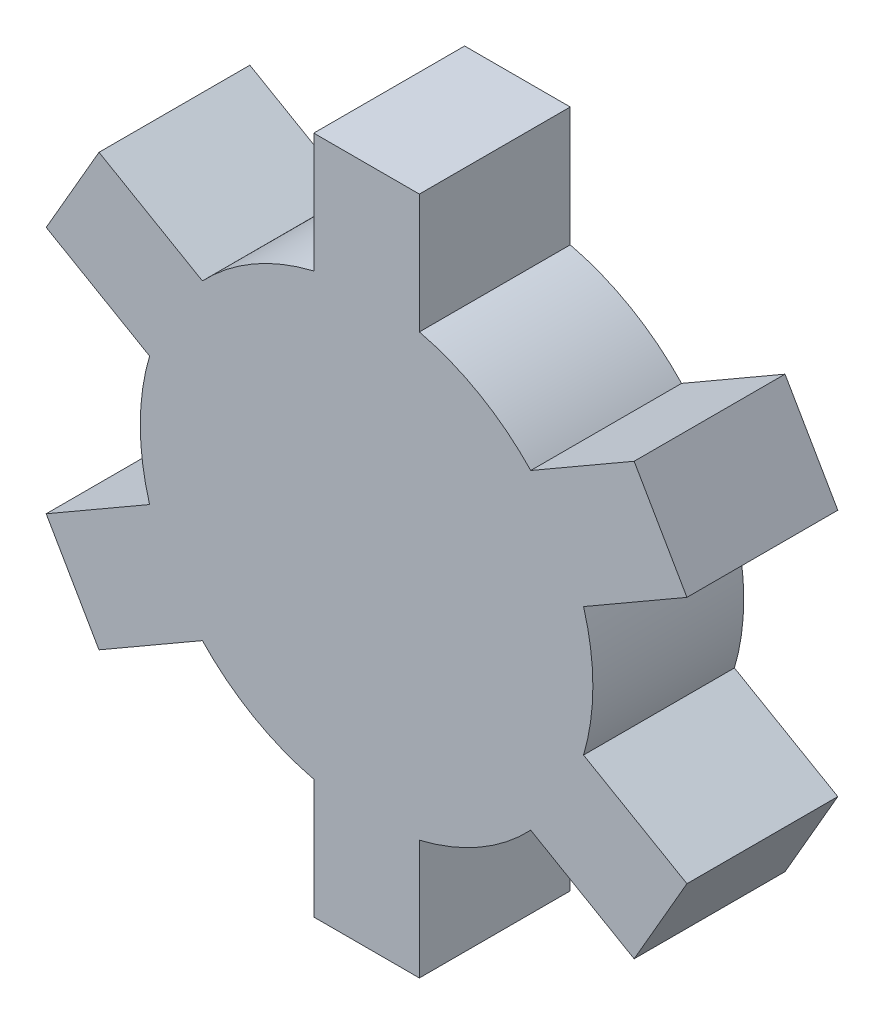
ISO-10303-21;
HEADER;
FILE_DESCRIPTION(('STEP AP214'),'2;1');
FILE_NAME('part.step','',(''),(''),'','','');
FILE_SCHEMA(('AUTOMOTIVE_DESIGN { 1 0 10303 214 1 1 1 1 }'));
ENDSEC;
DATA;
#1=APPLICATION_CONTEXT('core data for automotive mechanical design processes');
#2=APPLICATION_PROTOCOL_DEFINITION('international standard','automotive_design',2000,#1);
#3=PRODUCT_CONTEXT('',#1,'mechanical');
#4=PRODUCT('Part','Part','',(#3));
#5=PRODUCT_RELATED_PRODUCT_CATEGORY('part','',(#4));
#6=PRODUCT_DEFINITION_FORMATION('','',#4);
#7=PRODUCT_DEFINITION_CONTEXT('part definition',#1,'design');
#8=PRODUCT_DEFINITION('design','',#6,#7);
#9=PRODUCT_DEFINITION_SHAPE('','',#8);
#10=(LENGTH_UNIT() NAMED_UNIT(*) SI_UNIT(.MILLI.,.METRE.));
#11=(NAMED_UNIT(*) PLANE_ANGLE_UNIT() SI_UNIT($,.RADIAN.));
#12=(NAMED_UNIT(*) SI_UNIT($,.STERADIAN.) SOLID_ANGLE_UNIT());
#13=UNCERTAINTY_MEASURE_WITH_UNIT(LENGTH_MEASURE(1.E-05),#10,'distance_accuracy_value','');
#14=(GEOMETRIC_REPRESENTATION_CONTEXT(3) GLOBAL_UNCERTAINTY_ASSIGNED_CONTEXT((#13)) GLOBAL_UNIT_ASSIGNED_CONTEXT((#10,
#11,#12)) REPRESENTATION_CONTEXT('',''));
#15=CARTESIAN_POINT('',(0.,0.,0.));
#16=DIRECTION('',(0.,0.,1.));
#17=DIRECTION('',(1.,0.,0.));
#18=AXIS2_PLACEMENT_3D('',#15,#16,#17);
#19=CARTESIAN_POINT('',(0.,0.,10.));
#20=DIRECTION('',(0.,0.,-1.));
#21=DIRECTION('',(-1.,0.,0.));
#22=AXIS2_PLACEMENT_3D('',#19,#20,#21);
#23=CYLINDRICAL_SURFACE('',#22,15.);
#24=CARTESIAN_POINT('',(0.,0.,10.));
#25=DIRECTION('',(0.,0.,1.));
#26=DIRECTION('',(1.,0.,0.));
#27=AXIS2_PLACEMENT_3D('',#24,#25,#26);
#28=CIRCLE('',#27,15.);
#29=CARTESIAN_POINT('',(10.8818050966597,10.3240649861531,10.));
#30=VERTEX_POINT('',#29);
#31=CARTESIAN_POINT('',(3.5,14.5859521458148,10.));
#32=VERTEX_POINT('',#31);
#33=EDGE_CURVE('E45',#30,#32,#28,.T.);
#34=ORIENTED_EDGE('',*,*,#33,.F.);
#35=DIRECTION('',(0.,0.,-1.));
#36=VECTOR('',#35,1.);
#37=CARTESIAN_POINT('',(10.8818050966597,10.3240649861531,10.));
#38=LINE('',#37,#36);
#39=CARTESIAN_POINT('',(10.8818050966597,10.3240649861531,0.));
#40=VERTEX_POINT('',#39);
#41=EDGE_CURVE('E231',#30,#40,#38,.T.);
#42=ORIENTED_EDGE('',*,*,#41,.T.);
#43=CARTESIAN_POINT('',(0.,0.,0.));
#44=DIRECTION('',(0.,0.,1.));
#45=DIRECTION('',(1.,0.,0.));
#46=AXIS2_PLACEMENT_3D('',#43,#44,#45);
#47=CIRCLE('',#46,15.);
#48=CARTESIAN_POINT('',(3.5,14.5859521458148,0.));
#49=VERTEX_POINT('',#48);
#50=EDGE_CURVE('E356',#40,#49,#47,.T.);
#51=ORIENTED_EDGE('',*,*,#50,.T.);
#52=DIRECTION('',(0.,0.,-1.));
#53=VECTOR('',#52,1.);
#54=CARTESIAN_POINT('',(3.5,14.5859521458148,10.));
#55=LINE('',#54,#53);
#56=EDGE_CURVE('E352',#49,#32,#55,.F.);
#57=ORIENTED_EDGE('',*,*,#56,.T.);
#58=EDGE_LOOP('',(#34,#42,#51,#57));
#59=FACE_BOUND('',#58,.T.);
#60=ADVANCED_FACE('F35',(#59),#23,.T.);
#61=CARTESIAN_POINT('',(14.3818050966598,-4.26188715966174,0.));
#62=VERTEX_POINT('',#61);
#63=CARTESIAN_POINT('',(14.3818050966597,4.26188715966204,0.));
#64=VERTEX_POINT('',#63);
#65=EDGE_CURVE('E360',#62,#64,#47,.T.);
#66=ORIENTED_EDGE('',*,*,#65,.T.);
#67=DIRECTION('',(0.,0.,-1.));
#68=VECTOR('',#67,1.);
#69=CARTESIAN_POINT('',(14.3818050966597,4.26188715966204,10.));
#70=LINE('',#69,#68);
#71=CARTESIAN_POINT('',(14.3818050966597,4.26188715966204,10.));
#72=VERTEX_POINT('',#71);
#73=EDGE_CURVE('E59',#64,#72,#70,.F.);
#74=ORIENTED_EDGE('',*,*,#73,.T.);
#75=CARTESIAN_POINT('',(14.3818050966598,-4.26188715966174,10.));
#76=VERTEX_POINT('',#75);
#77=EDGE_CURVE('E206',#76,#72,#28,.T.);
#78=ORIENTED_EDGE('',*,*,#77,.F.);
#79=DIRECTION('',(0.,0.,-1.));
#80=VECTOR('',#79,1.);
#81=CARTESIAN_POINT('',(14.3818050966598,-4.26188715966174,10.));
#82=LINE('',#81,#80);
#83=EDGE_CURVE('E254',#76,#62,#82,.T.);
#84=ORIENTED_EDGE('',*,*,#83,.T.);
#85=EDGE_LOOP('',(#66,#74,#78,#84));
#86=FACE_BOUND('',#85,.T.);
#87=ADVANCED_FACE('F393',(#86),#23,.T.);
#88=CARTESIAN_POINT('',(3.5,-14.5859521458148,0.));
#89=VERTEX_POINT('',#88);
#90=CARTESIAN_POINT('',(10.8818050966599,-10.3240649861528,0.));
#91=VERTEX_POINT('',#90);
#92=EDGE_CURVE('E362',#89,#91,#47,.T.);
#93=ORIENTED_EDGE('',*,*,#92,.T.);
#94=DIRECTION('',(0.,0.,-1.));
#95=VECTOR('',#94,1.);
#96=CARTESIAN_POINT('',(10.8818050966599,-10.3240649861528,10.));
#97=LINE('',#96,#95);
#98=CARTESIAN_POINT('',(10.8818050966599,-10.3240649861528,10.));
#99=VERTEX_POINT('',#98);
#100=EDGE_CURVE('E252',#91,#99,#97,.F.);
#101=ORIENTED_EDGE('',*,*,#100,.T.);
#102=CARTESIAN_POINT('',(3.5,-14.5859521458148,10.));
#103=VERTEX_POINT('',#102);
#104=EDGE_CURVE('E394',#103,#99,#28,.T.);
#105=ORIENTED_EDGE('',*,*,#104,.F.);
#106=DIRECTION('',(0.,0.,-1.));
#107=VECTOR('',#106,1.);
#108=CARTESIAN_POINT('',(3.5,-14.5859521458148,10.));
#109=LINE('',#108,#107);
#110=EDGE_CURVE('E279',#103,#89,#109,.T.);
#111=ORIENTED_EDGE('',*,*,#110,.T.);
#112=EDGE_LOOP('',(#93,#101,#105,#111));
#113=FACE_BOUND('',#112,.T.);
#114=ADVANCED_FACE('F372',(#113),#23,.T.);
#115=CARTESIAN_POINT('',(-10.8818050966597,-10.324064986153,0.));
#116=VERTEX_POINT('',#115);
#117=CARTESIAN_POINT('',(-3.5,-14.5859521458148,0.));
#118=VERTEX_POINT('',#117);
#119=EDGE_CURVE('E365',#116,#118,#47,.T.);
#120=ORIENTED_EDGE('',*,*,#119,.T.);
#121=DIRECTION('',(0.,0.,-1.));
#122=VECTOR('',#121,1.);
#123=CARTESIAN_POINT('',(-3.5,-14.5859521458148,10.));
#124=LINE('',#123,#122);
#125=CARTESIAN_POINT('',(-3.5,-14.5859521458148,10.));
#126=VERTEX_POINT('',#125);
#127=EDGE_CURVE('E277',#118,#126,#124,.F.);
#128=ORIENTED_EDGE('',*,*,#127,.T.);
#129=CARTESIAN_POINT('',(-10.8818050966597,-10.324064986153,10.));
#130=VERTEX_POINT('',#129);
#131=EDGE_CURVE('E395',#130,#126,#28,.T.);
#132=ORIENTED_EDGE('',*,*,#131,.F.);
#133=DIRECTION('',(0.,0.,-1.));
#134=VECTOR('',#133,1.);
#135=CARTESIAN_POINT('',(-10.8818050966597,-10.324064986153,10.));
#136=LINE('',#135,#134);
#137=EDGE_CURVE('E304',#130,#116,#136,.T.);
#138=ORIENTED_EDGE('',*,*,#137,.T.);
#139=EDGE_LOOP('',(#120,#128,#132,#138));
#140=FACE_BOUND('',#139,.T.);
#141=ADVANCED_FACE('F416',(#140),#23,.T.);
#142=CARTESIAN_POINT('',(-14.3818050966598,4.26188715966184,0.));
#143=VERTEX_POINT('',#142);
#144=CARTESIAN_POINT('',(-14.3818050966598,-4.26188715966194,0.));
#145=VERTEX_POINT('',#144);
#146=EDGE_CURVE('E363',#143,#145,#47,.T.);
#147=ORIENTED_EDGE('',*,*,#146,.T.);
#148=DIRECTION('',(0.,0.,-1.));
#149=VECTOR('',#148,1.);
#150=CARTESIAN_POINT('',(-14.3818050966598,-4.26188715966194,10.));
#151=LINE('',#150,#149);
#152=CARTESIAN_POINT('',(-14.3818050966598,-4.26188715966194,10.));
#153=VERTEX_POINT('',#152);
#154=EDGE_CURVE('E302',#145,#153,#151,.F.);
#155=ORIENTED_EDGE('',*,*,#154,.T.);
#156=CARTESIAN_POINT('',(-14.3818050966598,4.26188715966184,10.));
#157=VERTEX_POINT('',#156);
#158=EDGE_CURVE('E44',#157,#153,#28,.T.);
#159=ORIENTED_EDGE('',*,*,#158,.F.);
#160=DIRECTION('',(0.,0.,-1.));
#161=VECTOR('',#160,1.);
#162=CARTESIAN_POINT('',(-14.3818050966598,4.26188715966184,10.));
#163=LINE('',#162,#161);
#164=EDGE_CURVE('E329',#157,#143,#163,.T.);
#165=ORIENTED_EDGE('',*,*,#164,.T.);
#166=EDGE_LOOP('',(#147,#155,#159,#165));
#167=FACE_BOUND('',#166,.T.);
#168=ADVANCED_FACE('F444',(#167),#23,.T.);
#169=CARTESIAN_POINT('',(-3.5,14.5859521458148,0.));
#170=VERTEX_POINT('',#169);
#171=CARTESIAN_POINT('',(-10.8818050966598,10.3240649861529,0.));
#172=VERTEX_POINT('',#171);
#173=EDGE_CURVE('E39',#170,#172,#47,.T.);
#174=ORIENTED_EDGE('',*,*,#173,.T.);
#175=DIRECTION('',(0.,0.,-1.));
#176=VECTOR('',#175,1.);
#177=CARTESIAN_POINT('',(-10.8818050966598,10.3240649861529,10.));
#178=LINE('',#177,#176);
#179=CARTESIAN_POINT('',(-10.8818050966598,10.3240649861529,10.));
#180=VERTEX_POINT('',#179);
#181=EDGE_CURVE('E327',#172,#180,#178,.F.);
#182=ORIENTED_EDGE('',*,*,#181,.T.);
#183=CARTESIAN_POINT('',(-3.5,14.5859521458148,10.));
#184=VERTEX_POINT('',#183);
#185=EDGE_CURVE('E11',#184,#180,#28,.T.);
#186=ORIENTED_EDGE('',*,*,#185,.F.);
#187=DIRECTION('',(0.,0.,-1.));
#188=VECTOR('',#187,1.);
#189=CARTESIAN_POINT('',(-3.5,14.5859521458148,10.));
#190=LINE('',#189,#188);
#191=EDGE_CURVE('E354',#184,#170,#190,.T.);
#192=ORIENTED_EDGE('',*,*,#191,.T.);
#193=EDGE_LOOP('',(#174,#182,#186,#192));
#194=FACE_BOUND('',#193,.T.);
#195=ADVANCED_FACE('F37',(#194),#23,.T.);
#196=CARTESIAN_POINT('',(0.,0.,10.));
#197=DIRECTION('',(0.,0.,1.));
#198=DIRECTION('',(1.,0.,0.));
#199=AXIS2_PLACEMENT_3D('',#196,#197,#198);
#200=PLANE('',#199);
#201=ORIENTED_EDGE('',*,*,#77,.T.);
#202=DIRECTION('',(0.866025403784433,0.50000000000001,0.));
#203=VECTOR('',#202,1.);
#204=CARTESIAN_POINT('',(8.24519052838328,0.718911086754561,10.));
#205=LINE('',#204,#203);
#206=CARTESIAN_POINT('',(21.2355715851498,8.21891108675471,10.));
#207=VERTEX_POINT('',#206);
#208=EDGE_CURVE('E198',#72,#207,#205,.T.);
#209=ORIENTED_EDGE('',*,*,#208,.T.);
#210=DIRECTION('',(-0.50000000000001,0.866025403784433,0.));
#211=VECTOR('',#210,1.);
#212=CARTESIAN_POINT('',(17.7355715851497,14.2810889132457,10.));
#213=LINE('',#212,#211);
#214=CARTESIAN_POINT('',(17.7355715851497,14.2810889132457,10.));
#215=VERTEX_POINT('',#214);
#216=EDGE_CURVE('E203',#207,#215,#213,.T.);
#217=ORIENTED_EDGE('',*,*,#216,.T.);
#218=DIRECTION('',(-0.866025403784433,-0.50000000000001,0.));
#219=VECTOR('',#218,1.);
#220=CARTESIAN_POINT('',(4.74519052838321,6.78108891324559,10.));
#221=LINE('',#220,#219);
#222=EDGE_CURVE('E218',#215,#30,#221,.T.);
#223=ORIENTED_EDGE('',*,*,#222,.T.);
#224=ORIENTED_EDGE('',*,*,#33,.T.);
#225=DIRECTION('',(0.,1.,0.));
#226=VECTOR('',#225,1.);
#227=CARTESIAN_POINT('',(3.5,7.5,10.));
#228=LINE('',#227,#226);
#229=CARTESIAN_POINT('',(3.5,22.5,10.));
#230=VERTEX_POINT('',#229);
#231=EDGE_CURVE('E332',#32,#230,#228,.T.);
#232=ORIENTED_EDGE('',*,*,#231,.T.);
#233=DIRECTION('',(-1.,0.,0.));
#234=VECTOR('',#233,1.);
#235=CARTESIAN_POINT('',(-3.5,22.5,10.));
#236=LINE('',#235,#234);
#237=CARTESIAN_POINT('',(-3.5,22.5,10.));
#238=VERTEX_POINT('',#237);
#239=EDGE_CURVE('E340',#230,#238,#236,.T.);
#240=ORIENTED_EDGE('',*,*,#239,.T.);
#241=DIRECTION('',(0.,-1.,0.));
#242=VECTOR('',#241,1.);
#243=CARTESIAN_POINT('',(-3.5,7.5,10.));
#244=LINE('',#243,#242);
#245=EDGE_CURVE('E343',#238,#184,#244,.T.);
#246=ORIENTED_EDGE('',*,*,#245,.T.);
#247=ORIENTED_EDGE('',*,*,#185,.T.);
#248=DIRECTION('',(-0.86602540378444,0.499999999999998,0.));
#249=VECTOR('',#248,1.);
#250=CARTESIAN_POINT('',(-4.74519052838331,6.78108891324552,10.));
#251=LINE('',#250,#249);
#252=CARTESIAN_POINT('',(-17.7355715851499,14.2810889132455,10.));
#253=VERTEX_POINT('',#252);
#254=EDGE_CURVE('E307',#180,#253,#251,.T.);
#255=ORIENTED_EDGE('',*,*,#254,.T.);
#256=DIRECTION('',(-0.499999999999998,-0.86602540378444,0.));
#257=VECTOR('',#256,1.);
#258=CARTESIAN_POINT('',(-21.2355715851499,8.21891108675442,10.));
#259=LINE('',#258,#257);
#260=CARTESIAN_POINT('',(-21.2355715851499,8.21891108675442,10.));
#261=VERTEX_POINT('',#260);
#262=EDGE_CURVE('E315',#253,#261,#259,.T.);
#263=ORIENTED_EDGE('',*,*,#262,.T.);
#264=DIRECTION('',(0.86602540378444,-0.499999999999998,0.));
#265=VECTOR('',#264,1.);
#266=CARTESIAN_POINT('',(-8.24519052838329,0.718911086754445,10.));
#267=LINE('',#266,#265);
#268=EDGE_CURVE('E318',#261,#157,#267,.T.);
#269=ORIENTED_EDGE('',*,*,#268,.T.);
#270=ORIENTED_EDGE('',*,*,#158,.T.);
#271=DIRECTION('',(-0.866025403784436,-0.500000000000004,0.));
#272=VECTOR('',#271,1.);
#273=CARTESIAN_POINT('',(-8.24519052838329,-0.718911086754503,10.));
#274=LINE('',#273,#272);
#275=CARTESIAN_POINT('',(-21.2355715851498,-8.21891108675456,10.));
#276=VERTEX_POINT('',#275);
#277=EDGE_CURVE('E282',#153,#276,#274,.T.);
#278=ORIENTED_EDGE('',*,*,#277,.T.);
#279=DIRECTION('',(0.500000000000004,-0.866025403784436,0.));
#280=VECTOR('',#279,1.);
#281=CARTESIAN_POINT('',(-17.7355715851498,-14.2810889132456,10.));
#282=LINE('',#281,#280);
#283=CARTESIAN_POINT('',(-17.7355715851498,-14.2810889132456,10.));
#284=VERTEX_POINT('',#283);
#285=EDGE_CURVE('E290',#276,#284,#282,.T.);
#286=ORIENTED_EDGE('',*,*,#285,.T.);
#287=DIRECTION('',(0.866025403784436,0.500000000000004,0.));
#288=VECTOR('',#287,1.);
#289=CARTESIAN_POINT('',(-4.74519052838326,-6.78108891324556,10.));
#290=LINE('',#289,#288);
#291=EDGE_CURVE('E293',#284,#130,#290,.T.);
#292=ORIENTED_EDGE('',*,*,#291,.T.);
#293=ORIENTED_EDGE('',*,*,#131,.T.);
#294=DIRECTION('',(0.,-1.,0.));
#295=VECTOR('',#294,1.);
#296=CARTESIAN_POINT('',(-3.5,-7.5,10.));
#297=LINE('',#296,#295);
#298=CARTESIAN_POINT('',(-3.5,-22.5,10.));
#299=VERTEX_POINT('',#298);
#300=EDGE_CURVE('E257',#126,#299,#297,.T.);
#301=ORIENTED_EDGE('',*,*,#300,.T.);
#302=DIRECTION('',(1.,0.,0.));
#303=VECTOR('',#302,1.);
#304=CARTESIAN_POINT('',(3.5,-22.5,10.));
#305=LINE('',#304,#303);
#306=CARTESIAN_POINT('',(3.5,-22.5,10.));
#307=VERTEX_POINT('',#306);
#308=EDGE_CURVE('E265',#299,#307,#305,.T.);
#309=ORIENTED_EDGE('',*,*,#308,.T.);
#310=DIRECTION('',(0.,1.,0.));
#311=VECTOR('',#310,1.);
#312=CARTESIAN_POINT('',(3.5,-7.5,10.));
#313=LINE('',#312,#311);
#314=EDGE_CURVE('E268',#307,#103,#313,.T.);
#315=ORIENTED_EDGE('',*,*,#314,.T.);
#316=ORIENTED_EDGE('',*,*,#104,.T.);
#317=DIRECTION('',(0.866025403784443,-0.499999999999992,0.));
#318=VECTOR('',#317,1.);
#319=CARTESIAN_POINT('',(4.74519052838335,-6.78108891324549,10.));
#320=LINE('',#319,#318);
#321=CARTESIAN_POINT('',(17.73557158515,-14.2810889132454,10.));
#322=VERTEX_POINT('',#321);
#323=EDGE_CURVE('E233',#99,#322,#320,.T.);
#324=ORIENTED_EDGE('',*,*,#323,.T.);
#325=DIRECTION('',(0.499999999999992,0.866025403784443,0.));
#326=VECTOR('',#325,1.);
#327=CARTESIAN_POINT('',(21.2355715851499,-8.21891108675427,10.));
#328=LINE('',#327,#326);
#329=CARTESIAN_POINT('',(21.2355715851499,-8.21891108675427,10.));
#330=VERTEX_POINT('',#329);
#331=EDGE_CURVE('E241',#322,#330,#328,.T.);
#332=ORIENTED_EDGE('',*,*,#331,.T.);
#333=DIRECTION('',(-0.866025403784443,0.499999999999992,0.));
#334=VECTOR('',#333,1.);
#335=CARTESIAN_POINT('',(8.2451905283833,-0.718911086754388,10.));
#336=LINE('',#335,#334);
#337=EDGE_CURVE('E244',#330,#76,#336,.T.);
#338=ORIENTED_EDGE('',*,*,#337,.T.);
#339=EDGE_LOOP('',(#201,#209,#217,#223,#224,#232,#240,#246,#247,#255,#263,#269,#270,#278,#286,
#292,#293,#301,#309,#315,#316,#324,#332,#338));
#340=FACE_BOUND('',#339,.T.);
#341=ADVANCED_FACE('F200',(#340),#200,.T.);
#342=CARTESIAN_POINT('',(0.,0.,0.));
#343=DIRECTION('',(0.,0.,1.));
#344=DIRECTION('',(1.,0.,0.));
#345=AXIS2_PLACEMENT_3D('',#342,#343,#344);
#346=PLANE('',#345);
#347=ORIENTED_EDGE('',*,*,#50,.F.);
#348=DIRECTION('',(0.866025403784433,0.50000000000001,0.));
#349=VECTOR('',#348,1.);
#350=CARTESIAN_POINT('',(4.74519052838321,6.78108891324559,0.));
#351=LINE('',#350,#349);
#352=CARTESIAN_POINT('',(17.7355715851497,14.2810889132457,0.));
#353=VERTEX_POINT('',#352);
#354=EDGE_CURVE('E229',#40,#353,#351,.T.);
#355=ORIENTED_EDGE('',*,*,#354,.T.);
#356=DIRECTION('',(0.50000000000001,-0.866025403784433,0.));
#357=VECTOR('',#356,1.);
#358=CARTESIAN_POINT('',(17.7355715851497,14.2810889132457,0.));
#359=LINE('',#358,#357);
#360=CARTESIAN_POINT('',(21.2355715851498,8.21891108675471,0.));
#361=VERTEX_POINT('',#360);
#362=EDGE_CURVE('E226',#353,#361,#359,.T.);
#363=ORIENTED_EDGE('',*,*,#362,.T.);
#364=DIRECTION('',(-0.866025403784433,-0.50000000000001,0.));
#365=VECTOR('',#364,1.);
#366=CARTESIAN_POINT('',(8.24519052838328,0.718911086754561,0.));
#367=LINE('',#366,#365);
#368=EDGE_CURVE('E214',#361,#64,#367,.T.);
#369=ORIENTED_EDGE('',*,*,#368,.T.);
#370=ORIENTED_EDGE('',*,*,#65,.F.);
#371=DIRECTION('',(0.866025403784443,-0.499999999999992,0.));
#372=VECTOR('',#371,1.);
#373=CARTESIAN_POINT('',(8.2451905283833,-0.718911086754388,0.));
#374=LINE('',#373,#372);
#375=CARTESIAN_POINT('',(21.2355715851499,-8.21891108675427,0.));
#376=VERTEX_POINT('',#375);
#377=EDGE_CURVE('E236',#62,#376,#374,.T.);
#378=ORIENTED_EDGE('',*,*,#377,.T.);
#379=DIRECTION('',(-0.499999999999992,-0.866025403784443,0.));
#380=VECTOR('',#379,1.);
#381=CARTESIAN_POINT('',(21.2355715851499,-8.21891108675427,0.));
#382=LINE('',#381,#380);
#383=CARTESIAN_POINT('',(17.73557158515,-14.2810889132454,0.));
#384=VERTEX_POINT('',#383);
#385=EDGE_CURVE('E234',#376,#384,#382,.T.);
#386=ORIENTED_EDGE('',*,*,#385,.T.);
#387=DIRECTION('',(-0.866025403784443,0.499999999999992,0.));
#388=VECTOR('',#387,1.);
#389=CARTESIAN_POINT('',(4.74519052838335,-6.78108891324549,0.));
#390=LINE('',#389,#388);
#391=EDGE_CURVE('E239',#384,#91,#390,.T.);
#392=ORIENTED_EDGE('',*,*,#391,.T.);
#393=ORIENTED_EDGE('',*,*,#92,.F.);
#394=DIRECTION('',(0.,-1.,0.));
#395=VECTOR('',#394,1.);
#396=CARTESIAN_POINT('',(3.5,-7.5,0.));
#397=LINE('',#396,#395);
#398=CARTESIAN_POINT('',(3.5,-22.5,0.));
#399=VERTEX_POINT('',#398);
#400=EDGE_CURVE('E260',#89,#399,#397,.T.);
#401=ORIENTED_EDGE('',*,*,#400,.T.);
#402=DIRECTION('',(-1.,0.,0.));
#403=VECTOR('',#402,1.);
#404=CARTESIAN_POINT('',(3.5,-22.5,0.));
#405=LINE('',#404,#403);
#406=CARTESIAN_POINT('',(-3.5,-22.5,0.));
#407=VERTEX_POINT('',#406);
#408=EDGE_CURVE('E258',#399,#407,#405,.T.);
#409=ORIENTED_EDGE('',*,*,#408,.T.);
#410=DIRECTION('',(0.,1.,0.));
#411=VECTOR('',#410,1.);
#412=CARTESIAN_POINT('',(-3.5,-7.5,0.));
#413=LINE('',#412,#411);
#414=EDGE_CURVE('E263',#407,#118,#413,.T.);
#415=ORIENTED_EDGE('',*,*,#414,.T.);
#416=ORIENTED_EDGE('',*,*,#119,.F.);
#417=DIRECTION('',(-0.866025403784436,-0.500000000000004,0.));
#418=VECTOR('',#417,1.);
#419=CARTESIAN_POINT('',(-4.74519052838326,-6.78108891324556,0.));
#420=LINE('',#419,#418);
#421=CARTESIAN_POINT('',(-17.7355715851498,-14.2810889132456,0.));
#422=VERTEX_POINT('',#421);
#423=EDGE_CURVE('E285',#116,#422,#420,.T.);
#424=ORIENTED_EDGE('',*,*,#423,.T.);
#425=DIRECTION('',(-0.500000000000004,0.866025403784436,0.));
#426=VECTOR('',#425,1.);
#427=CARTESIAN_POINT('',(-17.7355715851498,-14.2810889132456,0.));
#428=LINE('',#427,#426);
#429=CARTESIAN_POINT('',(-21.2355715851498,-8.21891108675456,0.));
#430=VERTEX_POINT('',#429);
#431=EDGE_CURVE('E283',#422,#430,#428,.T.);
#432=ORIENTED_EDGE('',*,*,#431,.T.);
#433=DIRECTION('',(0.866025403784436,0.500000000000004,0.));
#434=VECTOR('',#433,1.);
#435=CARTESIAN_POINT('',(-8.24519052838329,-0.718911086754503,0.));
#436=LINE('',#435,#434);
#437=EDGE_CURVE('E288',#430,#145,#436,.T.);
#438=ORIENTED_EDGE('',*,*,#437,.T.);
#439=ORIENTED_EDGE('',*,*,#146,.F.);
#440=DIRECTION('',(-0.86602540378444,0.499999999999998,0.));
#441=VECTOR('',#440,1.);
#442=CARTESIAN_POINT('',(-8.24519052838329,0.718911086754445,0.));
#443=LINE('',#442,#441);
#444=CARTESIAN_POINT('',(-21.2355715851499,8.21891108675442,0.));
#445=VERTEX_POINT('',#444);
#446=EDGE_CURVE('E310',#143,#445,#443,.T.);
#447=ORIENTED_EDGE('',*,*,#446,.T.);
#448=DIRECTION('',(0.499999999999998,0.86602540378444,0.));
#449=VECTOR('',#448,1.);
#450=CARTESIAN_POINT('',(-21.2355715851499,8.21891108675442,0.));
#451=LINE('',#450,#449);
#452=CARTESIAN_POINT('',(-17.7355715851499,14.2810889132455,0.));
#453=VERTEX_POINT('',#452);
#454=EDGE_CURVE('E308',#445,#453,#451,.T.);
#455=ORIENTED_EDGE('',*,*,#454,.T.);
#456=DIRECTION('',(0.86602540378444,-0.499999999999998,0.));
#457=VECTOR('',#456,1.);
#458=CARTESIAN_POINT('',(-4.74519052838331,6.78108891324552,0.));
#459=LINE('',#458,#457);
#460=EDGE_CURVE('E313',#453,#172,#459,.T.);
#461=ORIENTED_EDGE('',*,*,#460,.T.);
#462=ORIENTED_EDGE('',*,*,#173,.F.);
#463=DIRECTION('',(0.,1.,0.));
#464=VECTOR('',#463,1.);
#465=CARTESIAN_POINT('',(-3.5,7.5,0.));
#466=LINE('',#465,#464);
#467=CARTESIAN_POINT('',(-3.5,22.5,0.));
#468=VERTEX_POINT('',#467);
#469=EDGE_CURVE('E335',#170,#468,#466,.T.);
#470=ORIENTED_EDGE('',*,*,#469,.T.);
#471=DIRECTION('',(1.,0.,0.));
#472=VECTOR('',#471,1.);
#473=CARTESIAN_POINT('',(-3.5,22.5,0.));
#474=LINE('',#473,#472);
#475=CARTESIAN_POINT('',(3.5,22.5,0.));
#476=VERTEX_POINT('',#475);
#477=EDGE_CURVE('E333',#468,#476,#474,.T.);
#478=ORIENTED_EDGE('',*,*,#477,.T.);
#479=DIRECTION('',(0.,-1.,0.));
#480=VECTOR('',#479,1.);
#481=CARTESIAN_POINT('',(3.5,7.5,0.));
#482=LINE('',#481,#480);
#483=EDGE_CURVE('E338',#476,#49,#482,.T.);
#484=ORIENTED_EDGE('',*,*,#483,.T.);
#485=EDGE_LOOP('',(#347,#355,#363,#369,#370,#378,#386,#392,#393,#401,#409,#415,#416,#424,#432,
#438,#439,#447,#455,#461,#462,#470,#478,#484));
#486=FACE_BOUND('',#485,.T.);
#487=ADVANCED_FACE('F381',(#486),#346,.F.);
#488=CARTESIAN_POINT('',(-3.5,7.5,-16.5529453572468));
#489=DIRECTION('',(-1.,0.,0.));
#490=DIRECTION('',(0.,-1.,0.));
#491=AXIS2_PLACEMENT_3D('',#488,#489,#490);
#492=PLANE('',#491);
#493=ORIENTED_EDGE('',*,*,#191,.F.);
#494=ORIENTED_EDGE('',*,*,#245,.F.);
#495=DIRECTION('',(0.,0.,1.));
#496=VECTOR('',#495,1.);
#497=CARTESIAN_POINT('',(-3.5,22.5,-16.5529453572468));
#498=LINE('',#497,#496);
#499=EDGE_CURVE('E336',#468,#238,#498,.T.);
#500=ORIENTED_EDGE('',*,*,#499,.F.);
#501=ORIENTED_EDGE('',*,*,#469,.F.);
#502=EDGE_LOOP('',(#493,#494,#500,#501));
#503=FACE_BOUND('',#502,.T.);
#504=ADVANCED_FACE('F490',(#503),#492,.T.);
#505=CARTESIAN_POINT('',(3.5,7.5,-16.5529453572468));
#506=DIRECTION('',(1.,0.,0.));
#507=DIRECTION('',(0.,1.,0.));
#508=AXIS2_PLACEMENT_3D('',#505,#506,#507);
#509=PLANE('',#508);
#510=ORIENTED_EDGE('',*,*,#56,.F.);
#511=ORIENTED_EDGE('',*,*,#483,.F.);
#512=DIRECTION('',(0.,0.,1.));
#513=VECTOR('',#512,1.);
#514=CARTESIAN_POINT('',(3.5,22.5,-16.5529453572468));
#515=LINE('',#514,#513);
#516=EDGE_CURVE('E346',#476,#230,#515,.T.);
#517=ORIENTED_EDGE('',*,*,#516,.T.);
#518=ORIENTED_EDGE('',*,*,#231,.F.);
#519=EDGE_LOOP('',(#510,#511,#517,#518));
#520=FACE_BOUND('',#519,.T.);
#521=ADVANCED_FACE('F478',(#520),#509,.T.);
#522=CARTESIAN_POINT('',(-3.5,22.5,-16.5529453572468));
#523=DIRECTION('',(0.,1.,0.));
#524=DIRECTION('',(0.,0.,1.));
#525=AXIS2_PLACEMENT_3D('',#522,#523,#524);
#526=PLANE('',#525);
#527=ORIENTED_EDGE('',*,*,#477,.F.);
#528=ORIENTED_EDGE('',*,*,#499,.T.);
#529=ORIENTED_EDGE('',*,*,#239,.F.);
#530=ORIENTED_EDGE('',*,*,#516,.F.);
#531=EDGE_LOOP('',(#527,#528,#529,#530));
#532=FACE_BOUND('',#531,.T.);
#533=ADVANCED_FACE('F472',(#532),#526,.T.);
#534=CARTESIAN_POINT('',(-8.24519052838329,0.718911086754445,-21.3510031332191));
#535=DIRECTION('',(-0.499999999999998,-0.86602540378444,0.));
#536=DIRECTION('',(0.86602540378444,-0.499999999999998,0.));
#537=AXIS2_PLACEMENT_3D('',#534,#535,#536);
#538=PLANE('',#537);
#539=ORIENTED_EDGE('',*,*,#164,.F.);
#540=ORIENTED_EDGE('',*,*,#268,.F.);
#541=DIRECTION('',(0.,0.,1.));
#542=VECTOR('',#541,1.);
#543=CARTESIAN_POINT('',(-21.2355715851499,8.21891108675442,-21.3510031332191));
#544=LINE('',#543,#542);
#545=EDGE_CURVE('E311',#445,#261,#544,.T.);
#546=ORIENTED_EDGE('',*,*,#545,.F.);
#547=ORIENTED_EDGE('',*,*,#446,.F.);
#548=EDGE_LOOP('',(#539,#540,#546,#547));
#549=FACE_BOUND('',#548,.T.);
#550=ADVANCED_FACE('F477',(#549),#538,.T.);
#551=CARTESIAN_POINT('',(-4.74519052838331,6.78108891324552,-21.3510031332191));
#552=DIRECTION('',(0.499999999999998,0.86602540378444,0.));
#553=DIRECTION('',(-0.86602540378444,0.499999999999998,0.));
#554=AXIS2_PLACEMENT_3D('',#551,#552,#553);
#555=PLANE('',#554);
#556=ORIENTED_EDGE('',*,*,#181,.F.);
#557=ORIENTED_EDGE('',*,*,#460,.F.);
#558=DIRECTION('',(0.,0.,1.));
#559=VECTOR('',#558,1.);
#560=CARTESIAN_POINT('',(-17.7355715851499,14.2810889132455,-21.3510031332191));
#561=LINE('',#560,#559);
#562=EDGE_CURVE('E321',#453,#253,#561,.T.);
#563=ORIENTED_EDGE('',*,*,#562,.T.);
#564=ORIENTED_EDGE('',*,*,#254,.F.);
#565=EDGE_LOOP('',(#556,#557,#563,#564));
#566=FACE_BOUND('',#565,.T.);
#567=ADVANCED_FACE('F546',(#566),#555,.T.);
#568=CARTESIAN_POINT('',(-21.2355715851499,8.21891108675442,-21.3510031332191));
#569=DIRECTION('',(-0.86602540378444,0.499999999999998,0.));
#570=DIRECTION('',(-0.499999999999998,-0.86602540378444,0.));
#571=AXIS2_PLACEMENT_3D('',#568,#569,#570);
#572=PLANE('',#571);
#573=ORIENTED_EDGE('',*,*,#454,.F.);
#574=ORIENTED_EDGE('',*,*,#545,.T.);
#575=ORIENTED_EDGE('',*,*,#262,.F.);
#576=ORIENTED_EDGE('',*,*,#562,.F.);
#577=EDGE_LOOP('',(#573,#574,#575,#576));
#578=FACE_BOUND('',#577,.T.);
#579=ADVANCED_FACE('F556',(#578),#572,.T.);
#580=CARTESIAN_POINT('',(-4.74519052838326,-6.78108891324556,-21.3510031332191));
#581=DIRECTION('',(0.500000000000004,-0.866025403784436,0.));
#582=DIRECTION('',(0.866025403784436,0.500000000000004,0.));
#583=AXIS2_PLACEMENT_3D('',#580,#581,#582);
#584=PLANE('',#583);
#585=ORIENTED_EDGE('',*,*,#137,.F.);
#586=ORIENTED_EDGE('',*,*,#291,.F.);
#587=DIRECTION('',(0.,0.,1.));
#588=VECTOR('',#587,1.);
#589=CARTESIAN_POINT('',(-17.7355715851498,-14.2810889132456,-21.3510031332191));
#590=LINE('',#589,#588);
#591=EDGE_CURVE('E286',#422,#284,#590,.T.);
#592=ORIENTED_EDGE('',*,*,#591,.F.);
#593=ORIENTED_EDGE('',*,*,#423,.F.);
#594=EDGE_LOOP('',(#585,#586,#592,#593));
#595=FACE_BOUND('',#594,.T.);
#596=ADVANCED_FACE('F414',(#595),#584,.T.);
#597=CARTESIAN_POINT('',(-8.24519052838329,-0.718911086754503,-21.3510031332191));
#598=DIRECTION('',(-0.500000000000004,0.866025403784436,0.));
#599=DIRECTION('',(-0.866025403784436,-0.500000000000004,0.));
#600=AXIS2_PLACEMENT_3D('',#597,#598,#599);
#601=PLANE('',#600);
#602=ORIENTED_EDGE('',*,*,#154,.F.);
#603=ORIENTED_EDGE('',*,*,#437,.F.);
#604=DIRECTION('',(0.,0.,1.));
#605=VECTOR('',#604,1.);
#606=CARTESIAN_POINT('',(-21.2355715851498,-8.21891108675456,-21.3510031332191));
#607=LINE('',#606,#605);
#608=EDGE_CURVE('E296',#430,#276,#607,.T.);
#609=ORIENTED_EDGE('',*,*,#608,.T.);
#610=ORIENTED_EDGE('',*,*,#277,.F.);
#611=EDGE_LOOP('',(#602,#603,#609,#610));
#612=FACE_BOUND('',#611,.T.);
#613=ADVANCED_FACE('F403',(#612),#601,.T.);
#614=CARTESIAN_POINT('',(-17.7355715851498,-14.2810889132456,-21.3510031332191));
#615=DIRECTION('',(-0.866025403784436,-0.500000000000004,0.));
#616=DIRECTION('',(0.500000000000004,-0.866025403784436,0.));
#617=AXIS2_PLACEMENT_3D('',#614,#615,#616);
#618=PLANE('',#617);
#619=ORIENTED_EDGE('',*,*,#431,.F.);
#620=ORIENTED_EDGE('',*,*,#591,.T.);
#621=ORIENTED_EDGE('',*,*,#285,.F.);
#622=ORIENTED_EDGE('',*,*,#608,.F.);
#623=EDGE_LOOP('',(#619,#620,#621,#622));
#624=FACE_BOUND('',#623,.T.);
#625=ADVANCED_FACE('F409',(#624),#618,.T.);
#626=CARTESIAN_POINT('',(3.5,-7.5,-16.5529453572468));
#627=DIRECTION('',(1.,0.,0.));
#628=DIRECTION('',(0.,1.,0.));
#629=AXIS2_PLACEMENT_3D('',#626,#627,#628);
#630=PLANE('',#629);
#631=ORIENTED_EDGE('',*,*,#110,.F.);
#632=ORIENTED_EDGE('',*,*,#314,.F.);
#633=DIRECTION('',(0.,0.,1.));
#634=VECTOR('',#633,1.);
#635=CARTESIAN_POINT('',(3.5,-22.5,-16.5529453572468));
#636=LINE('',#635,#634);
#637=EDGE_CURVE('E261',#399,#307,#636,.T.);
#638=ORIENTED_EDGE('',*,*,#637,.F.);
#639=ORIENTED_EDGE('',*,*,#400,.F.);
#640=EDGE_LOOP('',(#631,#632,#638,#639));
#641=FACE_BOUND('',#640,.T.);
#642=ADVANCED_FACE('F428',(#641),#630,.T.);
#643=CARTESIAN_POINT('',(-3.5,-7.5,-16.5529453572468));
#644=DIRECTION('',(-1.,0.,0.));
#645=DIRECTION('',(0.,-1.,0.));
#646=AXIS2_PLACEMENT_3D('',#643,#644,#645);
#647=PLANE('',#646);
#648=ORIENTED_EDGE('',*,*,#127,.F.);
#649=ORIENTED_EDGE('',*,*,#414,.F.);
#650=DIRECTION('',(0.,0.,1.));
#651=VECTOR('',#650,1.);
#652=CARTESIAN_POINT('',(-3.5,-22.5,-16.5529453572468));
#653=LINE('',#652,#651);
#654=EDGE_CURVE('E271',#407,#299,#653,.T.);
#655=ORIENTED_EDGE('',*,*,#654,.T.);
#656=ORIENTED_EDGE('',*,*,#300,.F.);
#657=EDGE_LOOP('',(#648,#649,#655,#656));
#658=FACE_BOUND('',#657,.T.);
#659=ADVANCED_FACE('F419',(#658),#647,.T.);
#660=CARTESIAN_POINT('',(3.5,-22.5,-16.5529453572468));
#661=DIRECTION('',(0.,-1.,0.));
#662=DIRECTION('',(0.,0.,-1.));
#663=AXIS2_PLACEMENT_3D('',#660,#661,#662);
#664=PLANE('',#663);
#665=ORIENTED_EDGE('',*,*,#408,.F.);
#666=ORIENTED_EDGE('',*,*,#637,.T.);
#667=ORIENTED_EDGE('',*,*,#308,.F.);
#668=ORIENTED_EDGE('',*,*,#654,.F.);
#669=EDGE_LOOP('',(#665,#666,#667,#668));
#670=FACE_BOUND('',#669,.T.);
#671=ADVANCED_FACE('F425',(#670),#664,.T.);
#672=CARTESIAN_POINT('',(8.2451905283833,-0.718911086754388,-21.3510031332191));
#673=DIRECTION('',(0.499999999999992,0.866025403784443,0.));
#674=DIRECTION('',(-0.866025403784443,0.499999999999992,0.));
#675=AXIS2_PLACEMENT_3D('',#672,#673,#674);
#676=PLANE('',#675);
#677=ORIENTED_EDGE('',*,*,#83,.F.);
#678=ORIENTED_EDGE('',*,*,#337,.F.);
#679=DIRECTION('',(0.,0.,1.));
#680=VECTOR('',#679,1.);
#681=CARTESIAN_POINT('',(21.2355715851499,-8.21891108675427,-21.3510031332191));
#682=LINE('',#681,#680);
#683=EDGE_CURVE('E237',#376,#330,#682,.T.);
#684=ORIENTED_EDGE('',*,*,#683,.F.);
#685=ORIENTED_EDGE('',*,*,#377,.F.);
#686=EDGE_LOOP('',(#677,#678,#684,#685));
#687=FACE_BOUND('',#686,.T.);
#688=ADVANCED_FACE('F392',(#687),#676,.T.);
#689=CARTESIAN_POINT('',(4.74519052838335,-6.78108891324549,-21.3510031332191));
#690=DIRECTION('',(-0.499999999999992,-0.866025403784443,0.));
#691=DIRECTION('',(0.866025403784443,-0.499999999999992,0.));
#692=AXIS2_PLACEMENT_3D('',#689,#690,#691);
#693=PLANE('',#692);
#694=ORIENTED_EDGE('',*,*,#100,.F.);
#695=ORIENTED_EDGE('',*,*,#391,.F.);
#696=DIRECTION('',(0.,0.,1.));
#697=VECTOR('',#696,1.);
#698=CARTESIAN_POINT('',(17.73557158515,-14.2810889132454,-21.3510031332191));
#699=LINE('',#698,#697);
#700=EDGE_CURVE('E246',#384,#322,#699,.T.);
#701=ORIENTED_EDGE('',*,*,#700,.T.);
#702=ORIENTED_EDGE('',*,*,#323,.F.);
#703=EDGE_LOOP('',(#694,#695,#701,#702));
#704=FACE_BOUND('',#703,.T.);
#705=ADVANCED_FACE('F380',(#704),#693,.T.);
#706=CARTESIAN_POINT('',(21.2355715851499,-8.21891108675427,-21.3510031332191));
#707=DIRECTION('',(0.866025403784443,-0.499999999999992,0.));
#708=DIRECTION('',(0.499999999999992,0.866025403784443,0.));
#709=AXIS2_PLACEMENT_3D('',#706,#707,#708);
#710=PLANE('',#709);
#711=ORIENTED_EDGE('',*,*,#385,.F.);
#712=ORIENTED_EDGE('',*,*,#683,.T.);
#713=ORIENTED_EDGE('',*,*,#331,.F.);
#714=ORIENTED_EDGE('',*,*,#700,.F.);
#715=EDGE_LOOP('',(#711,#712,#713,#714));
#716=FACE_BOUND('',#715,.T.);
#717=ADVANCED_FACE('F388',(#716),#710,.T.);
#718=CARTESIAN_POINT('',(4.74519052838321,6.78108891324559,-21.3510031332192));
#719=DIRECTION('',(-0.50000000000001,0.866025403784433,0.));
#720=DIRECTION('',(-0.866025403784433,-0.50000000000001,0.));
#721=AXIS2_PLACEMENT_3D('',#718,#719,#720);
#722=PLANE('',#721);
#723=ORIENTED_EDGE('',*,*,#41,.F.);
#724=ORIENTED_EDGE('',*,*,#222,.F.);
#725=DIRECTION('',(0.,0.,1.));
#726=VECTOR('',#725,1.);
#727=CARTESIAN_POINT('',(17.7355715851497,14.2810889132457,-21.3510031332192));
#728=LINE('',#727,#726);
#729=EDGE_CURVE('E217',#353,#215,#728,.T.);
#730=ORIENTED_EDGE('',*,*,#729,.F.);
#731=ORIENTED_EDGE('',*,*,#354,.F.);
#732=EDGE_LOOP('',(#723,#724,#730,#731));
#733=FACE_BOUND('',#732,.T.);
#734=ADVANCED_FACE('F630',(#733),#722,.T.);
#735=CARTESIAN_POINT('',(8.24519052838328,0.718911086754561,-21.3510031332192));
#736=DIRECTION('',(0.50000000000001,-0.866025403784433,0.));
#737=DIRECTION('',(0.866025403784433,0.50000000000001,0.));
#738=AXIS2_PLACEMENT_3D('',#735,#736,#737);
#739=PLANE('',#738);
#740=ORIENTED_EDGE('',*,*,#73,.F.);
#741=ORIENTED_EDGE('',*,*,#368,.F.);
#742=DIRECTION('',(0.,0.,1.));
#743=VECTOR('',#742,1.);
#744=CARTESIAN_POINT('',(21.2355715851498,8.21891108675471,-21.3510031332192));
#745=LINE('',#744,#743);
#746=EDGE_CURVE('E211',#361,#207,#745,.T.);
#747=ORIENTED_EDGE('',*,*,#746,.T.);
#748=ORIENTED_EDGE('',*,*,#208,.F.);
#749=EDGE_LOOP('',(#740,#741,#747,#748));
#750=FACE_BOUND('',#749,.T.);
#751=ADVANCED_FACE('F212',(#750),#739,.T.);
#752=CARTESIAN_POINT('',(17.7355715851497,14.2810889132457,-21.3510031332192));
#753=DIRECTION('',(0.866025403784433,0.50000000000001,0.));
#754=DIRECTION('',(-0.50000000000001,0.866025403784433,0.));
#755=AXIS2_PLACEMENT_3D('',#752,#753,#754);
#756=PLANE('',#755);
#757=ORIENTED_EDGE('',*,*,#362,.F.);
#758=ORIENTED_EDGE('',*,*,#729,.T.);
#759=ORIENTED_EDGE('',*,*,#216,.F.);
#760=ORIENTED_EDGE('',*,*,#746,.F.);
#761=EDGE_LOOP('',(#757,#758,#759,#760));
#762=FACE_BOUND('',#761,.T.);
#763=ADVANCED_FACE('F220',(#762),#756,.T.);
#764=CLOSED_SHELL('',(#60,#87,#114,#141,#168,#195,#341,#487,#504,#521,#533,#550,#567,#579,#596,
#613,#625,#642,#659,#671,#688,#705,#717,#734,#751,#763));
#765=MANIFOLD_SOLID_BREP('B2',#764);
#766=ADVANCED_BREP_SHAPE_REPRESENTATION('',(#18,#765),#14);
#767=SHAPE_DEFINITION_REPRESENTATION(#9,#766);
ENDSEC;
END-ISO-10303-21;
